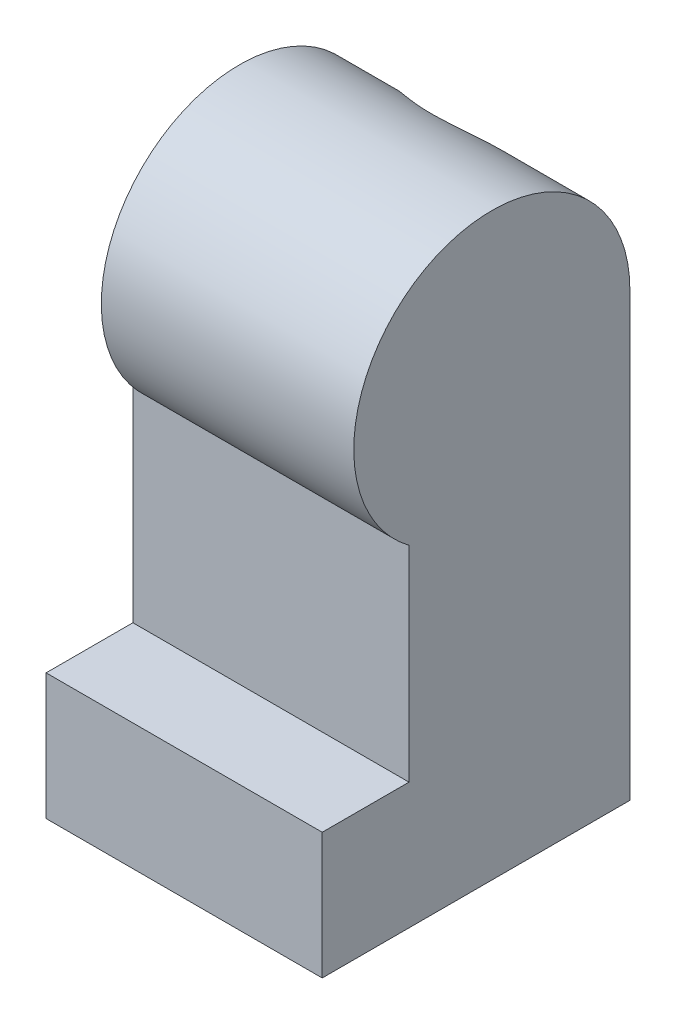
ISO-10303-21;
HEADER;
FILE_DESCRIPTION(('STEP AP214'),'2;1');
FILE_NAME('part.step','',(''),(''),'','','');
FILE_SCHEMA(('AUTOMOTIVE_DESIGN { 1 0 10303 214 1 1 1 1 }'));
ENDSEC;
DATA;
#1=APPLICATION_CONTEXT('core data for automotive mechanical design processes');
#2=APPLICATION_PROTOCOL_DEFINITION('international standard','automotive_design',2000,#1);
#3=PRODUCT_CONTEXT('',#1,'mechanical');
#4=PRODUCT('Part','Part','',(#3));
#5=PRODUCT_RELATED_PRODUCT_CATEGORY('part','',(#4));
#6=PRODUCT_DEFINITION_FORMATION('','',#4);
#7=PRODUCT_DEFINITION_CONTEXT('part definition',#1,'design');
#8=PRODUCT_DEFINITION('design','',#6,#7);
#9=PRODUCT_DEFINITION_SHAPE('','',#8);
#10=(LENGTH_UNIT() NAMED_UNIT(*) SI_UNIT(.MILLI.,.METRE.));
#11=(NAMED_UNIT(*) PLANE_ANGLE_UNIT() SI_UNIT($,.RADIAN.));
#12=(NAMED_UNIT(*) SI_UNIT($,.STERADIAN.) SOLID_ANGLE_UNIT());
#13=UNCERTAINTY_MEASURE_WITH_UNIT(LENGTH_MEASURE(1.E-05),#10,'distance_accuracy_value','');
#14=(GEOMETRIC_REPRESENTATION_CONTEXT(3) GLOBAL_UNCERTAINTY_ASSIGNED_CONTEXT((#13)) GLOBAL_UNIT_ASSIGNED_CONTEXT((#10,
#11,#12)) REPRESENTATION_CONTEXT('',''));
#15=CARTESIAN_POINT('',(0.,0.,0.));
#16=DIRECTION('',(0.,0.,1.));
#17=DIRECTION('',(1.,0.,0.));
#18=AXIS2_PLACEMENT_3D('',#15,#16,#17);
#19=CARTESIAN_POINT('',(-3.5,0.500000000000002,-1.7));
#20=DIRECTION('',(0.,0.,-1.));
#21=DIRECTION('',(0.,1.,0.));
#22=AXIS2_PLACEMENT_3D('',#19,#20,#21);
#23=PLANE('',#22);
#24=DIRECTION('',(-1.,0.,0.));
#25=VECTOR('',#24,1.);
#26=CARTESIAN_POINT('',(0.,2.2,-1.7));
#27=LINE('',#26,#25);
#28=CARTESIAN_POINT('',(-1.80589256539026,2.2,-1.7));
#29=VERTEX_POINT('',#28);
#30=CARTESIAN_POINT('',(-4.50589256539026,2.2,-1.7));
#31=VERTEX_POINT('',#30);
#32=EDGE_CURVE('E57',#29,#31,#27,.T.);
#33=ORIENTED_EDGE('',*,*,#32,.T.);
#34=DIRECTION('',(0.,-1.,0.));
#35=VECTOR('',#34,1.);
#36=CARTESIAN_POINT('',(-4.50589256539026,0.,-1.7));
#37=LINE('',#36,#35);
#38=CARTESIAN_POINT('',(-4.50589256539026,-1.67903192883734,-1.7));
#39=VERTEX_POINT('',#38);
#40=EDGE_CURVE('E181',#31,#39,#37,.T.);
#41=ORIENTED_EDGE('',*,*,#40,.T.);
#42=CARTESIAN_POINT('',(-3.5,0.500000000000002,-1.7));
#43=DIRECTION('',(0.,0.,-1.));
#44=DIRECTION('',(0.,1.,0.));
#45=AXIS2_PLACEMENT_3D('',#42,#43,#44);
#46=CIRCLE('',#45,2.4);
#47=EDGE_CURVE('E197',#39,#29,#46,.T.);
#48=ORIENTED_EDGE('',*,*,#47,.T.);
#49=EDGE_LOOP('',(#33,#41,#48));
#50=FACE_BOUND('',#49,.T.);
#51=ADVANCED_FACE('F37',(#50),#23,.T.);
#52=CARTESIAN_POINT('',(0.,-2.3,-1.8));
#53=DIRECTION('',(0.,0.,-1.));
#54=DIRECTION('',(0.,1.,0.));
#55=AXIS2_PLACEMENT_3D('',#52,#53,#54);
#56=PLANE('',#55);
#57=DIRECTION('',(0.,-1.,0.));
#58=VECTOR('',#57,1.);
#59=CARTESIAN_POINT('',(-1.1,-2.3,-1.8));
#60=LINE('',#59,#58);
#61=CARTESIAN_POINT('',(-1.1,-7.3,-1.8));
#62=VERTEX_POINT('',#61);
#63=CARTESIAN_POINT('',(-1.1,-11.2,-1.8));
#64=VERTEX_POINT('',#63);
#65=EDGE_CURVE('E421',#62,#64,#60,.T.);
#66=ORIENTED_EDGE('',*,*,#65,.F.);
#67=CARTESIAN_POINT('',(-3.5,-7.3,-1.8));
#68=DIRECTION('',(0.,0.,-1.));
#69=DIRECTION('',(0.,1.,0.));
#70=AXIS2_PLACEMENT_3D('',#67,#68,#69);
#71=CIRCLE('',#70,2.4);
#72=CARTESIAN_POINT('',(-5.9,-7.3,-1.8));
#73=VERTEX_POINT('',#72);
#74=EDGE_CURVE('E277',#62,#73,#71,.T.);
#75=ORIENTED_EDGE('',*,*,#74,.T.);
#76=DIRECTION('',(0.,-1.,0.));
#77=VECTOR('',#76,1.);
#78=CARTESIAN_POINT('',(-5.9,-2.3,-1.8));
#79=LINE('',#78,#77);
#80=CARTESIAN_POINT('',(-5.9,-11.2,-1.8));
#81=VERTEX_POINT('',#80);
#82=EDGE_CURVE('E427',#73,#81,#79,.T.);
#83=ORIENTED_EDGE('',*,*,#82,.T.);
#84=DIRECTION('',(1.,0.,0.));
#85=VECTOR('',#84,1.);
#86=CARTESIAN_POINT('',(0.,-11.2,-1.8));
#87=LINE('',#86,#85);
#88=EDGE_CURVE('E435',#81,#64,#87,.T.);
#89=ORIENTED_EDGE('',*,*,#88,.T.);
#90=EDGE_LOOP('',(#66,#75,#83,#89));
#91=FACE_BOUND('',#90,.T.);
#92=ADVANCED_FACE('F320',(#91),#56,.F.);
#93=CARTESIAN_POINT('',(-7.,-11.2,0.));
#94=DIRECTION('',(0.,1.,0.));
#95=DIRECTION('',(0.,0.,1.));
#96=AXIS2_PLACEMENT_3D('',#93,#94,#95);
#97=PLANE('',#96);
#98=DIRECTION('',(0.,0.,1.));
#99=VECTOR('',#98,1.);
#100=CARTESIAN_POINT('',(0.,-11.2,0.));
#101=LINE('',#100,#99);
#102=CARTESIAN_POINT('',(0.,-11.2,-3.5));
#103=VERTEX_POINT('',#102);
#104=CARTESIAN_POINT('',(0.,-11.2,4.3));
#105=VERTEX_POINT('',#104);
#106=EDGE_CURVE('E396',#103,#105,#101,.T.);
#107=ORIENTED_EDGE('',*,*,#106,.T.);
#108=DIRECTION('',(1.,0.,0.));
#109=VECTOR('',#108,1.);
#110=CARTESIAN_POINT('',(-7.,-11.2,4.3));
#111=LINE('',#110,#109);
#112=CARTESIAN_POINT('',(-7.,-11.2,4.3));
#113=VERTEX_POINT('',#112);
#114=EDGE_CURVE('E383',#113,#105,#111,.T.);
#115=ORIENTED_EDGE('',*,*,#114,.F.);
#116=DIRECTION('',(0.,0.,1.));
#117=VECTOR('',#116,1.);
#118=CARTESIAN_POINT('',(-7.,-11.2,0.));
#119=LINE('',#118,#117);
#120=CARTESIAN_POINT('',(-7.,-11.2,-3.5));
#121=VERTEX_POINT('',#120);
#122=EDGE_CURVE('E407',#121,#113,#119,.T.);
#123=ORIENTED_EDGE('',*,*,#122,.F.);
#124=DIRECTION('',(1.,0.,0.));
#125=VECTOR('',#124,1.);
#126=CARTESIAN_POINT('',(-7.,-11.2,-3.5));
#127=LINE('',#126,#125);
#128=EDGE_CURVE('E386',#121,#103,#127,.T.);
#129=ORIENTED_EDGE('',*,*,#128,.T.);
#130=EDGE_LOOP('',(#107,#115,#123,#129));
#131=FACE_BOUND('',#130,.T.);
#132=DIRECTION('',(0.,0.,1.));
#133=VECTOR('',#132,1.);
#134=CARTESIAN_POINT('',(-5.9,-11.2,0.));
#135=LINE('',#134,#133);
#136=CARTESIAN_POINT('',(-5.9,-11.2,2.9));
#137=VERTEX_POINT('',#136);
#138=EDGE_CURVE('E430',#81,#137,#135,.T.);
#139=ORIENTED_EDGE('',*,*,#138,.T.);
#140=DIRECTION('',(1.,0.,0.));
#141=VECTOR('',#140,1.);
#142=CARTESIAN_POINT('',(0.,-11.2,2.9));
#143=LINE('',#142,#141);
#144=CARTESIAN_POINT('',(-1.1,-11.2,2.9));
#145=VERTEX_POINT('',#144);
#146=EDGE_CURVE('E283',#137,#145,#143,.T.);
#147=ORIENTED_EDGE('',*,*,#146,.T.);
#148=DIRECTION('',(0.,0.,1.));
#149=VECTOR('',#148,1.);
#150=CARTESIAN_POINT('',(-1.1,-11.2,0.));
#151=LINE('',#150,#149);
#152=EDGE_CURVE('E433',#64,#145,#151,.T.);
#153=ORIENTED_EDGE('',*,*,#152,.F.);
#154=ORIENTED_EDGE('',*,*,#88,.F.);
#155=EDGE_LOOP('',(#139,#147,#153,#154));
#156=FACE_BOUND('',#155,.T.);
#157=ADVANCED_FACE('F311',(#131,#156),#97,.F.);
#158=CARTESIAN_POINT('',(0.,-2.3,1.5));
#159=DIRECTION('',(0.,0.,-1.));
#160=DIRECTION('',(0.,1.,0.));
#161=AXIS2_PLACEMENT_3D('',#158,#159,#160);
#162=PLANE('',#161);
#163=DIRECTION('',(0.,-1.,0.));
#164=VECTOR('',#163,1.);
#165=CARTESIAN_POINT('',(-1.1,-2.3,1.5));
#166=LINE('',#165,#164);
#167=CARTESIAN_POINT('',(-1.1,-2.3,1.5));
#168=VERTEX_POINT('',#167);
#169=CARTESIAN_POINT('',(-1.1,-9.2,1.5));
#170=VERTEX_POINT('',#169);
#171=EDGE_CURVE('E420',#168,#170,#166,.T.);
#172=ORIENTED_EDGE('',*,*,#171,.T.);
#173=DIRECTION('',(1.,0.,0.));
#174=VECTOR('',#173,1.);
#175=CARTESIAN_POINT('',(0.,-9.2,1.5));
#176=LINE('',#175,#174);
#177=CARTESIAN_POINT('',(-5.9,-9.2,1.5));
#178=VERTEX_POINT('',#177);
#179=EDGE_CURVE('E284',#178,#170,#176,.T.);
#180=ORIENTED_EDGE('',*,*,#179,.F.);
#181=DIRECTION('',(0.,-1.,0.));
#182=VECTOR('',#181,1.);
#183=CARTESIAN_POINT('',(-5.9,-2.3,1.5));
#184=LINE('',#183,#182);
#185=CARTESIAN_POINT('',(-5.9,-2.3,1.5));
#186=VERTEX_POINT('',#185);
#187=EDGE_CURVE('E424',#186,#178,#184,.T.);
#188=ORIENTED_EDGE('',*,*,#187,.F.);
#189=DIRECTION('',(1.,0.,0.));
#190=VECTOR('',#189,1.);
#191=CARTESIAN_POINT('',(0.,-2.3,1.5));
#192=LINE('',#191,#190);
#193=EDGE_CURVE('E441',#186,#168,#192,.T.);
#194=ORIENTED_EDGE('',*,*,#193,.T.);
#195=EDGE_LOOP('',(#172,#180,#188,#194));
#196=FACE_BOUND('',#195,.T.);
#197=ADVANCED_FACE('F308',(#196),#162,.T.);
#198=CARTESIAN_POINT('',(-6.4,0.,0.));
#199=DIRECTION('',(1.,0.,0.));
#200=DIRECTION('',(0.,0.,-1.));
#201=AXIS2_PLACEMENT_3D('',#198,#199,#200);
#202=CYLINDRICAL_SURFACE('',#201,3.5);
#203=CARTESIAN_POINT('',(-5.8473389188611,0.,-3.5));
#204=CARTESIAN_POINT('',(-5.85952324799212,0.0571477217374247,-3.50001181867057));
#205=CARTESIAN_POINT('',(-5.86959863933398,0.114743770065322,-3.49860061614223));
#206=CARTESIAN_POINT('',(-5.88551560428378,0.230360407827149,-3.49288728833139));
#207=CARTESIAN_POINT('',(-5.89135828784083,0.288380881929227,-3.48858592151156));
#208=CARTESIAN_POINT('',(-5.8987800738924,0.404089359673819,-3.47707880110764));
#209=CARTESIAN_POINT('',(-5.90038218120077,0.461777456069779,-3.46988896332483));
#210=CARTESIAN_POINT('',(-5.89946378384657,0.576676567862824,-3.45265487837301));
#211=CARTESIAN_POINT('',(-5.89694326407962,0.633887581511211,-3.44261062074615));
#212=CARTESIAN_POINT('',(-5.88336595556229,0.804105036209103,-3.4083356117771));
#213=CARTESIAN_POINT('',(-5.86630384227635,0.915869866292524,-3.37994514796454));
#214=CARTESIAN_POINT('',(-5.8176646602164,1.13314832429677,-3.31344895138059));
#215=CARTESIAN_POINT('',(-5.78607230536925,1.23865523648251,-3.27533300607753));
#216=CARTESIAN_POINT('',(-5.70809491628295,1.44731564674367,-3.18884504357403));
#217=CARTESIAN_POINT('',(-5.66097838899282,1.55000373794561,-3.14001706082533));
#218=CARTESIAN_POINT('',(-5.55467670041225,1.74526360748642,-3.03584021966201));
#219=CARTESIAN_POINT('',(-5.49548649772666,1.83783113507598,-2.98048864139242));
#220=CARTESIAN_POINT('',(-5.35353573776811,2.03018562272158,-2.85379750966277));
#221=CARTESIAN_POINT('',(-5.26842986956987,2.12760502281981,-2.78149734246403));
#222=CARTESIAN_POINT('',(-5.08471660055205,2.30698502977076,-2.63462775579363));
#223=CARTESIAN_POINT('',(-4.98609165576467,2.38892521486053,-2.56005548720432));
#224=CARTESIAN_POINT('',(-4.78326463330637,2.53162908276111,-2.41871956278776));
#225=CARTESIAN_POINT('',(-4.67995301376685,2.59348192527748,-2.3517770338946));
#226=CARTESIAN_POINT('',(-4.46138451080996,2.70240840583052,-2.22572729179699));
#227=CARTESIAN_POINT('',(-4.34615403536234,2.74951382379002,-2.16660339102304));
#228=CARTESIAN_POINT('',(-4.14772757712701,2.81234304649958,-2.08383834027692));
#229=CARTESIAN_POINT('',(-4.06831867472429,2.83323788763357,-2.05514190190293));
#230=CARTESIAN_POINT('',(-3.90499381872968,2.86704539023275,-2.0077106103014));
#231=CARTESIAN_POINT('',(-3.82108827656746,2.87997569256307,-1.98895375460871));
#232=CARTESIAN_POINT('',(-3.64949120839477,2.89690144617538,-1.9642337035912));
#233=CARTESIAN_POINT('',(-3.56176894903616,2.9008005995437,-1.95840842288825));
#234=CARTESIAN_POINT('',(-3.38665261282273,2.89892227463507,-1.96118525247281));
#235=CARTESIAN_POINT('',(-3.2992586376826,2.89314201115589,-1.96979151536345));
#236=CARTESIAN_POINT('',(-3.11997573015766,2.87160130715171,-2.0010690476172));
#237=CARTESIAN_POINT('',(-3.02841815728649,2.85496763238069,-2.02496702821198));
#238=CARTESIAN_POINT('',(-2.85105317430008,2.81241019263364,-2.08366151371945));
#239=CARTESIAN_POINT('',(-2.76526360077856,2.78645905439294,-2.11849009267811));
#240=CARTESIAN_POINT('',(-2.61773079012412,2.73301571417906,-2.18679788954712));
#241=CARTESIAN_POINT('',(-2.55478723431316,2.70705840232988,-2.21895300854011));
#242=CARTESIAN_POINT('',(-2.43253952688268,2.6505953738598,-2.28610481874925));
#243=CARTESIAN_POINT('',(-2.37323749385825,2.62008704424715,-2.32110313711189));
#244=CARTESIAN_POINT('',(-2.20045968614499,2.52207206221612,-2.42868720689748));
#245=CARTESIAN_POINT('',(-2.09218099861509,2.4481010718627,-2.50382746204864));
#246=CARTESIAN_POINT('',(-1.88360823330202,2.27939132717921,-2.65861963929727));
#247=CARTESIAN_POINT('',(-1.78407812901597,2.18373583955497,-2.73829291655651));
#248=CARTESIAN_POINT('',(-1.60137340449738,1.97459276266238,-2.89271972414266));
#249=CARTESIAN_POINT('',(-1.51817479248159,1.86113177857626,-2.96748036225121));
#250=CARTESIAN_POINT('',(-1.3827076469627,1.63641660452187,-3.09615262794245));
#251=CARTESIAN_POINT('',(-1.32762439761678,1.52768128659246,-3.1514891082545));
#252=CARTESIAN_POINT('',(-1.23355837193325,1.29903752936263,-3.25238946581503));
#253=CARTESIAN_POINT('',(-1.19457083515538,1.17913240650189,-3.29795623061858));
#254=CARTESIAN_POINT('',(-1.1501708545183,0.992412245075312,-3.35700281785587));
#255=CARTESIAN_POINT('',(-1.13769076115729,0.928685601014829,-3.37520301505509));
#256=CARTESIAN_POINT('',(-1.11787508897714,0.799562026687039,-3.40809707788925));
#257=CARTESIAN_POINT('',(-1.11053670135105,0.734166028622356,-3.42279285501696));
#258=CARTESIAN_POINT('',(-1.1012748142032,0.602361890113004,-3.44842924317227));
#259=CARTESIAN_POINT('',(-1.09934358386222,0.535955331323925,-3.45937519578144));
#260=CARTESIAN_POINT('',(-1.10104813363846,0.402723056835077,-3.47740236223998));
#261=CARTESIAN_POINT('',(-1.10468020548551,0.335897649885479,-3.4844861461866));
#262=CARTESIAN_POINT('',(-1.1154853741884,0.224046580330875,-3.49311564200003));
#263=CARTESIAN_POINT('',(-1.12113712347402,0.178946589127802,-3.49571088870466));
#264=CARTESIAN_POINT('',(-1.1349923537418,0.0891432677126933,-3.49915350020635));
#265=CARTESIAN_POINT('',(-1.14319194086814,0.0444394385561719,-3.50000351725482));
#266=CARTESIAN_POINT('',(-1.15266108113889,0.,-3.5));
#267=B_SPLINE_CURVE_WITH_KNOTS('',3,(#203,#204,#205,#206,#207,#208,#209,#210,#211,#212,#213,
#214,#215,#216,#217,#218,#219,#220,#221,#222,#223,#224,#225,#226,#227,#228,#229,#230,#231,#232,
#233,#234,#235,#236,#237,#238,#239,#240,#241,#242,#243,#244,#245,#246,#247,#248,#249,#250,#251,
#252,#253,#254,#255,#256,#257,#258,#259,#260,#261,#262,#263,#264,#265,#266),.UNSPECIFIED.,.F.,
.F.,(4,2,2,2,2,2,2,2,2,2,2,2,2,2,2,2,2,2,2,2,2,2,2,2,2,2,2,2,2,2,2,4),(0.,0.175237440381033,
0.35042891134353,0.524668014814338,0.698907756660255,1.04686867533735,1.39519649537508,
1.76309807782818,2.13115359418281,2.57414809278723,3.01772301461145,3.42986501795747,
3.84111266440891,4.10124897819194,4.36080701764205,4.62312019539684,4.88550886538463,
5.17215450827924,5.45964925644542,5.68524281978454,5.91096641102047,6.36265437457838,
6.83912330739456,7.31488695708917,7.71498529590946,8.11496521741379,8.31702682714792,
8.51897796858323,8.720640224955,8.92216811998134,9.05864817270439,9.19492066068158),.UNSPECIFIED.);
#268=CARTESIAN_POINT('',(-5.8473389188611,0.,-3.5));
#269=VERTEX_POINT('',#268);
#270=CARTESIAN_POINT('',(-1.1526610811389,0.,-3.5));
#271=VERTEX_POINT('',#270);
#272=EDGE_CURVE('E64',#269,#271,#267,.T.);
#273=ORIENTED_EDGE('',*,*,#272,.F.);
#274=DIRECTION('',(1.,0.,0.));
#275=VECTOR('',#274,1.);
#276=CARTESIAN_POINT('',(-7.,0.,-3.5));
#277=LINE('',#276,#275);
#278=CARTESIAN_POINT('',(-6.4,0.,-3.5));
#279=VERTEX_POINT('',#278);
#280=EDGE_CURVE('E392',#279,#269,#277,.T.);
#281=ORIENTED_EDGE('',*,*,#280,.F.);
#282=CARTESIAN_POINT('',(-6.4,0.,0.));
#283=DIRECTION('',(1.,0.,0.));
#284=DIRECTION('',(0.,0.,-1.));
#285=AXIS2_PLACEMENT_3D('',#282,#283,#284);
#286=CIRCLE('',#285,3.5);
#287=CARTESIAN_POINT('',(-6.4,-2.8,2.1));
#288=VERTEX_POINT('',#287);
#289=EDGE_CURVE('E12',#279,#288,#286,.T.);
#290=ORIENTED_EDGE('',*,*,#289,.T.);
#291=DIRECTION('',(1.,0.,0.));
#292=VECTOR('',#291,1.);
#293=CARTESIAN_POINT('',(-7.,-2.8,2.1));
#294=LINE('',#293,#292);
#295=CARTESIAN_POINT('',(0.,-2.8,2.1));
#296=VERTEX_POINT('',#295);
#297=EDGE_CURVE('E377',#288,#296,#294,.T.);
#298=ORIENTED_EDGE('',*,*,#297,.T.);
#299=CARTESIAN_POINT('',(0.,0.,0.));
#300=DIRECTION('',(1.,0.,0.));
#301=DIRECTION('',(0.,0.,-1.));
#302=AXIS2_PLACEMENT_3D('',#299,#300,#301);
#303=CIRCLE('',#302,3.5);
#304=CARTESIAN_POINT('',(0.,0.,-3.5));
#305=VERTEX_POINT('',#304);
#306=EDGE_CURVE('E49',#305,#296,#303,.T.);
#307=ORIENTED_EDGE('',*,*,#306,.F.);
#308=EDGE_CURVE('E389',#271,#305,#277,.T.);
#309=ORIENTED_EDGE('',*,*,#308,.F.);
#310=EDGE_LOOP('',(#273,#281,#290,#298,#307,#309));
#311=FACE_BOUND('',#310,.T.);
#312=ADVANCED_FACE('F39',(#311),#202,.T.);
#313=CARTESIAN_POINT('',(-6.4,0.,0.));
#314=DIRECTION('',(1.,0.,0.));
#315=DIRECTION('',(0.,0.,-1.));
#316=AXIS2_PLACEMENT_3D('',#313,#314,#315);
#317=PLANE('',#316);
#318=CARTESIAN_POINT('',(-6.4,0.,0.));
#319=DIRECTION('',(-1.,0.,0.));
#320=DIRECTION('',(0.,0.,1.));
#321=AXIS2_PLACEMENT_3D('',#318,#319,#320);
#322=CIRCLE('',#321,1.125);
#323=CARTESIAN_POINT('',(-6.4,0.,1.125));
#324=VERTEX_POINT('',#323);
#325=EDGE_CURVE('E203',#324,#324,#322,.T.);
#326=ORIENTED_EDGE('',*,*,#325,.F.);
#327=EDGE_LOOP('',(#326));
#328=FACE_BOUND('',#327,.T.);
#329=ORIENTED_EDGE('',*,*,#289,.F.);
#330=CARTESIAN_POINT('',(-6.4,0.,0.));
#331=DIRECTION('',(1.,0.,0.));
#332=DIRECTION('',(0.,0.,-1.));
#333=AXIS2_PLACEMENT_3D('',#330,#331,#332);
#334=CIRCLE('',#333,3.5);
#335=EDGE_CURVE('E369',#288,#279,#334,.T.);
#336=ORIENTED_EDGE('',*,*,#335,.F.);
#337=EDGE_LOOP('',(#329,#336));
#338=FACE_BOUND('',#337,.T.);
#339=ADVANCED_FACE('F348',(#328,#338),#317,.F.);
#340=CARTESIAN_POINT('',(0.,0.,0.));
#341=DIRECTION('',(1.,0.,0.));
#342=DIRECTION('',(0.,0.,-1.));
#343=AXIS2_PLACEMENT_3D('',#340,#341,#342);
#344=PLANE('',#343);
#345=ORIENTED_EDGE('',*,*,#306,.T.);
#346=DIRECTION('',(0.,1.,0.));
#347=VECTOR('',#346,1.);
#348=CARTESIAN_POINT('',(0.,0.,2.1));
#349=LINE('',#348,#347);
#350=CARTESIAN_POINT('',(0.,-8.,2.1));
#351=VERTEX_POINT('',#350);
#352=EDGE_CURVE('E402',#351,#296,#349,.T.);
#353=ORIENTED_EDGE('',*,*,#352,.F.);
#354=DIRECTION('',(0.,0.,-1.));
#355=VECTOR('',#354,1.);
#356=CARTESIAN_POINT('',(0.,-8.,0.));
#357=LINE('',#356,#355);
#358=CARTESIAN_POINT('',(0.,-8.,4.3));
#359=VERTEX_POINT('',#358);
#360=EDGE_CURVE('E400',#359,#351,#357,.T.);
#361=ORIENTED_EDGE('',*,*,#360,.F.);
#362=DIRECTION('',(0.,1.,0.));
#363=VECTOR('',#362,1.);
#364=CARTESIAN_POINT('',(0.,0.,4.3));
#365=LINE('',#364,#363);
#366=EDGE_CURVE('E398',#105,#359,#365,.T.);
#367=ORIENTED_EDGE('',*,*,#366,.F.);
#368=ORIENTED_EDGE('',*,*,#106,.F.);
#369=DIRECTION('',(0.,-1.,0.));
#370=VECTOR('',#369,1.);
#371=CARTESIAN_POINT('',(0.,0.,-3.5));
#372=LINE('',#371,#370);
#373=EDGE_CURVE('E393',#305,#103,#372,.T.);
#374=ORIENTED_EDGE('',*,*,#373,.F.);
#375=EDGE_LOOP('',(#345,#353,#361,#367,#368,#374));
#376=FACE_BOUND('',#375,.T.);
#377=ADVANCED_FACE('F346',(#376),#344,.T.);
#378=CARTESIAN_POINT('',(-7.,0.,0.));
#379=DIRECTION('',(1.,0.,0.));
#380=DIRECTION('',(0.,0.,-1.));
#381=AXIS2_PLACEMENT_3D('',#378,#379,#380);
#382=CYLINDRICAL_SURFACE('',#381,3.5);
#383=CARTESIAN_POINT('',(-7.,-2.8,2.1));
#384=VERTEX_POINT('',#383);
#385=EDGE_CURVE('E373',#384,#288,#294,.T.);
#386=ORIENTED_EDGE('',*,*,#385,.T.);
#387=ORIENTED_EDGE('',*,*,#335,.T.);
#388=CARTESIAN_POINT('',(-7.,0.,-3.5));
#389=VERTEX_POINT('',#388);
#390=EDGE_CURVE('E372',#389,#279,#277,.T.);
#391=ORIENTED_EDGE('',*,*,#390,.F.);
#392=CARTESIAN_POINT('',(-7.,0.,0.));
#393=DIRECTION('',(1.,0.,0.));
#394=DIRECTION('',(0.,0.,-1.));
#395=AXIS2_PLACEMENT_3D('',#392,#393,#394);
#396=CIRCLE('',#395,3.5);
#397=EDGE_CURVE('E395',#384,#389,#396,.T.);
#398=ORIENTED_EDGE('',*,*,#397,.F.);
#399=EDGE_LOOP('',(#386,#387,#391,#398));
#400=FACE_BOUND('',#399,.T.);
#401=ADVANCED_FACE('F329',(#400),#382,.F.);
#402=CARTESIAN_POINT('',(-7.,0.,-3.5));
#403=DIRECTION('',(0.,0.,1.));
#404=DIRECTION('',(0.,-1.,0.));
#405=AXIS2_PLACEMENT_3D('',#402,#403,#404);
#406=PLANE('',#405);
#407=CARTESIAN_POINT('',(-3.5,-7.3,-3.5));
#408=DIRECTION('',(0.,0.,-1.));
#409=DIRECTION('',(0.,1.,0.));
#410=AXIS2_PLACEMENT_3D('',#407,#408,#409);
#411=CIRCLE('',#410,2.4);
#412=CARTESIAN_POINT('',(-3.5,-4.9,-3.5));
#413=VERTEX_POINT('',#412);
#414=EDGE_CURVE('E271',#413,#413,#411,.T.);
#415=ORIENTED_EDGE('',*,*,#414,.F.);
#416=EDGE_LOOP('',(#415));
#417=FACE_BOUND('',#416,.T.);
#418=ORIENTED_EDGE('',*,*,#280,.T.);
#419=CARTESIAN_POINT('',(-3.5,0.500000000000002,-3.5));
#420=DIRECTION('',(0.,0.,-1.));
#421=DIRECTION('',(0.,1.,0.));
#422=AXIS2_PLACEMENT_3D('',#419,#420,#421);
#423=CIRCLE('',#422,2.4);
#424=EDGE_CURVE('E264',#271,#269,#423,.T.);
#425=ORIENTED_EDGE('',*,*,#424,.F.);
#426=ORIENTED_EDGE('',*,*,#308,.T.);
#427=ORIENTED_EDGE('',*,*,#373,.T.);
#428=ORIENTED_EDGE('',*,*,#128,.F.);
#429=DIRECTION('',(0.,-1.,0.));
#430=VECTOR('',#429,1.);
#431=CARTESIAN_POINT('',(-7.,0.,-3.5));
#432=LINE('',#431,#430);
#433=EDGE_CURVE('E405',#389,#121,#432,.T.);
#434=ORIENTED_EDGE('',*,*,#433,.F.);
#435=ORIENTED_EDGE('',*,*,#390,.T.);
#436=EDGE_LOOP('',(#418,#425,#426,#427,#428,#434,#435));
#437=FACE_BOUND('',#436,.T.);
#438=ADVANCED_FACE('F325',(#417,#437),#406,.F.);
#439=CARTESIAN_POINT('',(-7.,0.,4.3));
#440=DIRECTION('',(0.,0.,-1.));
#441=DIRECTION('',(0.,1.,0.));
#442=AXIS2_PLACEMENT_3D('',#439,#440,#441);
#443=PLANE('',#442);
#444=ORIENTED_EDGE('',*,*,#366,.T.);
#445=DIRECTION('',(1.,0.,0.));
#446=VECTOR('',#445,1.);
#447=CARTESIAN_POINT('',(-7.,-8.,4.3));
#448=LINE('',#447,#446);
#449=CARTESIAN_POINT('',(-7.,-8.,4.3));
#450=VERTEX_POINT('',#449);
#451=EDGE_CURVE('E380',#450,#359,#448,.T.);
#452=ORIENTED_EDGE('',*,*,#451,.F.);
#453=DIRECTION('',(0.,1.,0.));
#454=VECTOR('',#453,1.);
#455=CARTESIAN_POINT('',(-7.,0.,4.3));
#456=LINE('',#455,#454);
#457=EDGE_CURVE('E409',#113,#450,#456,.T.);
#458=ORIENTED_EDGE('',*,*,#457,.F.);
#459=ORIENTED_EDGE('',*,*,#114,.T.);
#460=EDGE_LOOP('',(#444,#452,#458,#459));
#461=FACE_BOUND('',#460,.T.);
#462=ADVANCED_FACE('F328',(#461),#443,.F.);
#463=CARTESIAN_POINT('',(-7.,-8.,0.));
#464=DIRECTION('',(0.,-1.,0.));
#465=DIRECTION('',(0.,0.,-1.));
#466=AXIS2_PLACEMENT_3D('',#463,#464,#465);
#467=PLANE('',#466);
#468=ORIENTED_EDGE('',*,*,#360,.T.);
#469=DIRECTION('',(1.,0.,0.));
#470=VECTOR('',#469,1.);
#471=CARTESIAN_POINT('',(-7.,-8.,2.1));
#472=LINE('',#471,#470);
#473=CARTESIAN_POINT('',(-7.,-8.,2.1));
#474=VERTEX_POINT('',#473);
#475=EDGE_CURVE('E376',#474,#351,#472,.T.);
#476=ORIENTED_EDGE('',*,*,#475,.F.);
#477=DIRECTION('',(0.,0.,-1.));
#478=VECTOR('',#477,1.);
#479=CARTESIAN_POINT('',(-7.,-8.,0.));
#480=LINE('',#479,#478);
#481=EDGE_CURVE('E411',#450,#474,#480,.T.);
#482=ORIENTED_EDGE('',*,*,#481,.F.);
#483=ORIENTED_EDGE('',*,*,#451,.T.);
#484=EDGE_LOOP('',(#468,#476,#482,#483));
#485=FACE_BOUND('',#484,.T.);
#486=ADVANCED_FACE('F336',(#485),#467,.F.);
#487=CARTESIAN_POINT('',(-7.,0.,2.1));
#488=DIRECTION('',(0.,0.,-1.));
#489=DIRECTION('',(0.,1.,0.));
#490=AXIS2_PLACEMENT_3D('',#487,#488,#489);
#491=PLANE('',#490);
#492=ORIENTED_EDGE('',*,*,#352,.T.);
#493=ORIENTED_EDGE('',*,*,#297,.F.);
#494=ORIENTED_EDGE('',*,*,#385,.F.);
#495=DIRECTION('',(0.,1.,0.));
#496=VECTOR('',#495,1.);
#497=CARTESIAN_POINT('',(-7.,0.,2.1));
#498=LINE('',#497,#496);
#499=EDGE_CURVE('E413',#474,#384,#498,.T.);
#500=ORIENTED_EDGE('',*,*,#499,.F.);
#501=ORIENTED_EDGE('',*,*,#475,.T.);
#502=EDGE_LOOP('',(#492,#493,#494,#500,#501));
#503=FACE_BOUND('',#502,.T.);
#504=ADVANCED_FACE('F323',(#503),#491,.F.);
#505=CARTESIAN_POINT('',(-7.,0.,0.));
#506=DIRECTION('',(1.,0.,0.));
#507=DIRECTION('',(0.,0.,-1.));
#508=AXIS2_PLACEMENT_3D('',#505,#506,#507);
#509=PLANE('',#508);
#510=ORIENTED_EDGE('',*,*,#397,.T.);
#511=ORIENTED_EDGE('',*,*,#433,.T.);
#512=ORIENTED_EDGE('',*,*,#122,.T.);
#513=ORIENTED_EDGE('',*,*,#457,.T.);
#514=ORIENTED_EDGE('',*,*,#481,.T.);
#515=ORIENTED_EDGE('',*,*,#499,.T.);
#516=EDGE_LOOP('',(#510,#511,#512,#513,#514,#515));
#517=FACE_BOUND('',#516,.T.);
#518=ADVANCED_FACE('F318',(#517),#509,.F.);
#519=CARTESIAN_POINT('',(-5.9,-2.3,-1.8));
#520=VERTEX_POINT('',#519);
#521=EDGE_CURVE('E404',#520,#73,#79,.T.);
#522=ORIENTED_EDGE('',*,*,#521,.T.);
#523=EDGE_CURVE('E274',#73,#62,#71,.T.);
#524=ORIENTED_EDGE('',*,*,#523,.T.);
#525=CARTESIAN_POINT('',(-1.1,-2.3,-1.8));
#526=VERTEX_POINT('',#525);
#527=EDGE_CURVE('E417',#526,#62,#60,.T.);
#528=ORIENTED_EDGE('',*,*,#527,.F.);
#529=DIRECTION('',(1.,0.,0.));
#530=VECTOR('',#529,1.);
#531=CARTESIAN_POINT('',(0.,-2.3,-1.8));
#532=LINE('',#531,#530);
#533=EDGE_CURVE('E432',#520,#526,#532,.T.);
#534=ORIENTED_EDGE('',*,*,#533,.F.);
#535=EDGE_LOOP('',(#522,#524,#528,#534));
#536=FACE_BOUND('',#535,.T.);
#537=ADVANCED_FACE('F306',(#536),#56,.F.);
#538=CARTESIAN_POINT('',(-5.9,-2.3,0.));
#539=DIRECTION('',(1.,0.,0.));
#540=DIRECTION('',(0.,0.,-1.));
#541=AXIS2_PLACEMENT_3D('',#538,#539,#540);
#542=PLANE('',#541);
#543=ORIENTED_EDGE('',*,*,#82,.F.);
#544=ORIENTED_EDGE('',*,*,#521,.F.);
#545=DIRECTION('',(0.,0.,1.));
#546=VECTOR('',#545,1.);
#547=CARTESIAN_POINT('',(-5.9,-2.3,0.));
#548=LINE('',#547,#546);
#549=EDGE_CURVE('E439',#520,#186,#548,.T.);
#550=ORIENTED_EDGE('',*,*,#549,.T.);
#551=ORIENTED_EDGE('',*,*,#187,.T.);
#552=DIRECTION('',(0.,0.,1.));
#553=VECTOR('',#552,1.);
#554=CARTESIAN_POINT('',(-5.9,-9.2,0.));
#555=LINE('',#554,#553);
#556=CARTESIAN_POINT('',(-5.9,-9.2,2.9));
#557=VERTEX_POINT('',#556);
#558=EDGE_CURVE('E451',#178,#557,#555,.T.);
#559=ORIENTED_EDGE('',*,*,#558,.T.);
#560=DIRECTION('',(0.,-1.,0.));
#561=VECTOR('',#560,1.);
#562=CARTESIAN_POINT('',(-5.9,-9.2,2.9));
#563=LINE('',#562,#561);
#564=EDGE_CURVE('E438',#557,#137,#563,.T.);
#565=ORIENTED_EDGE('',*,*,#564,.T.);
#566=ORIENTED_EDGE('',*,*,#138,.F.);
#567=EDGE_LOOP('',(#543,#544,#550,#551,#559,#565,#566));
#568=FACE_BOUND('',#567,.T.);
#569=ADVANCED_FACE('F303',(#568),#542,.T.);
#570=CARTESIAN_POINT('',(-1.1,-2.3,0.));
#571=DIRECTION('',(1.,0.,0.));
#572=DIRECTION('',(0.,0.,-1.));
#573=AXIS2_PLACEMENT_3D('',#570,#571,#572);
#574=PLANE('',#573);
#575=ORIENTED_EDGE('',*,*,#527,.T.);
#576=ORIENTED_EDGE('',*,*,#65,.T.);
#577=ORIENTED_EDGE('',*,*,#152,.T.);
#578=DIRECTION('',(0.,-1.,0.));
#579=VECTOR('',#578,1.);
#580=CARTESIAN_POINT('',(-1.1,-9.2,2.9));
#581=LINE('',#580,#579);
#582=CARTESIAN_POINT('',(-1.1,-9.2,2.9));
#583=VERTEX_POINT('',#582);
#584=EDGE_CURVE('E448',#583,#145,#581,.T.);
#585=ORIENTED_EDGE('',*,*,#584,.F.);
#586=DIRECTION('',(0.,0.,1.));
#587=VECTOR('',#586,1.);
#588=CARTESIAN_POINT('',(-1.1,-9.2,0.));
#589=LINE('',#588,#587);
#590=EDGE_CURVE('E458',#170,#583,#589,.T.);
#591=ORIENTED_EDGE('',*,*,#590,.F.);
#592=ORIENTED_EDGE('',*,*,#171,.F.);
#593=DIRECTION('',(0.,0.,1.));
#594=VECTOR('',#593,1.);
#595=CARTESIAN_POINT('',(-1.1,-2.3,0.));
#596=LINE('',#595,#594);
#597=EDGE_CURVE('E443',#526,#168,#596,.T.);
#598=ORIENTED_EDGE('',*,*,#597,.F.);
#599=EDGE_LOOP('',(#575,#576,#577,#585,#591,#592,#598));
#600=FACE_BOUND('',#599,.T.);
#601=ADVANCED_FACE('F301',(#600),#574,.F.);
#602=CARTESIAN_POINT('',(0.,-2.3,0.));
#603=DIRECTION('',(0.,-1.,0.));
#604=DIRECTION('',(0.,0.,-1.));
#605=AXIS2_PLACEMENT_3D('',#602,#603,#604);
#606=PLANE('',#605);
#607=ORIENTED_EDGE('',*,*,#533,.T.);
#608=ORIENTED_EDGE('',*,*,#597,.T.);
#609=ORIENTED_EDGE('',*,*,#193,.F.);
#610=ORIENTED_EDGE('',*,*,#549,.F.);
#611=EDGE_LOOP('',(#607,#608,#609,#610));
#612=FACE_BOUND('',#611,.T.);
#613=ADVANCED_FACE('F297',(#612),#606,.T.);
#614=CARTESIAN_POINT('',(0.,-9.2,2.9));
#615=DIRECTION('',(0.,0.,-1.));
#616=DIRECTION('',(0.,1.,0.));
#617=AXIS2_PLACEMENT_3D('',#614,#615,#616);
#618=PLANE('',#617);
#619=ORIENTED_EDGE('',*,*,#146,.F.);
#620=ORIENTED_EDGE('',*,*,#564,.F.);
#621=DIRECTION('',(1.,0.,0.));
#622=VECTOR('',#621,1.);
#623=CARTESIAN_POINT('',(0.,-9.2,2.9));
#624=LINE('',#623,#622);
#625=EDGE_CURVE('E457',#557,#583,#624,.T.);
#626=ORIENTED_EDGE('',*,*,#625,.T.);
#627=ORIENTED_EDGE('',*,*,#584,.T.);
#628=EDGE_LOOP('',(#619,#620,#626,#627));
#629=FACE_BOUND('',#628,.T.);
#630=ADVANCED_FACE('F293',(#629),#618,.T.);
#631=CARTESIAN_POINT('',(0.,-9.2,0.));
#632=DIRECTION('',(0.,-1.,0.));
#633=DIRECTION('',(0.,0.,-1.));
#634=AXIS2_PLACEMENT_3D('',#631,#632,#633);
#635=PLANE('',#634);
#636=ORIENTED_EDGE('',*,*,#179,.T.);
#637=ORIENTED_EDGE('',*,*,#590,.T.);
#638=ORIENTED_EDGE('',*,*,#625,.F.);
#639=ORIENTED_EDGE('',*,*,#558,.F.);
#640=EDGE_LOOP('',(#636,#637,#638,#639));
#641=FACE_BOUND('',#640,.T.);
#642=ADVANCED_FACE('F289',(#641),#635,.T.);
#643=CARTESIAN_POINT('',(-3.5,-7.3,-1.7));
#644=DIRECTION('',(0.,0.,-1.));
#645=DIRECTION('',(0.,1.,0.));
#646=AXIS2_PLACEMENT_3D('',#643,#644,#645);
#647=CYLINDRICAL_SURFACE('',#646,2.4);
#648=ORIENTED_EDGE('',*,*,#414,.T.);
#649=EDGE_LOOP('',(#648));
#650=FACE_BOUND('',#649,.T.);
#651=ORIENTED_EDGE('',*,*,#523,.F.);
#652=ORIENTED_EDGE('',*,*,#74,.F.);
#653=EDGE_LOOP('',(#651,#652));
#654=FACE_BOUND('',#653,.T.);
#655=ADVANCED_FACE('F239',(#650,#654),#647,.F.);
#656=CARTESIAN_POINT('',(-3.5,0.500000000000002,-1.7));
#657=DIRECTION('',(0.,0.,-1.));
#658=DIRECTION('',(0.,1.,0.));
#659=AXIS2_PLACEMENT_3D('',#656,#657,#658);
#660=CYLINDRICAL_SURFACE('',#659,2.4);
#661=ORIENTED_EDGE('',*,*,#272,.T.);
#662=ORIENTED_EDGE('',*,*,#424,.T.);
#663=EDGE_LOOP('',(#661,#662));
#664=FACE_BOUND('',#663,.T.);
#665=CARTESIAN_POINT('',(-1.80589256539026,-1.2,-1.7));
#666=VERTEX_POINT('',#665);
#667=EDGE_CURVE('E269',#29,#666,#46,.T.);
#668=ORIENTED_EDGE('',*,*,#667,.F.);
#669=ORIENTED_EDGE('',*,*,#47,.F.);
#670=DIRECTION('',(0.,0.,-1.));
#671=VECTOR('',#670,1.);
#672=CARTESIAN_POINT('',(-4.50589256539026,-1.67903192883735,6.701));
#673=LINE('',#672,#671);
#674=CARTESIAN_POINT('',(-4.50589256539026,-1.67903192883734,1.57189432912799));
#675=VERTEX_POINT('',#674);
#676=EDGE_CURVE('E186',#675,#39,#673,.T.);
#677=ORIENTED_EDGE('',*,*,#676,.F.);
#678=CARTESIAN_POINT('',(-4.03329166503893,-1.84,1.38));
#679=CARTESIAN_POINT('',(-4.0751437578678,-1.83045975727594,1.39272341654453));
#680=CARTESIAN_POINT('',(-4.11639656717299,-1.81987920856244,1.40655351959038));
#681=CARTESIAN_POINT('',(-4.19755767122536,-1.79677805251896,1.43594367086238));
#682=CARTESIAN_POINT('',(-4.2374701083403,-1.78426425445949,1.45149759511151));
#683=CARTESIAN_POINT('',(-4.31608590615937,-1.75737242312821,1.48394268682891));
#684=CARTESIAN_POINT('',(-4.35478948242254,-1.74299472460176,1.50083361396788));
#685=CARTESIAN_POINT('',(-4.43115457838779,-1.71238447403466,1.53567007040377));
#686=CARTESIAN_POINT('',(-4.46881203397668,-1.69614568268615,1.55361904301443));
#687=CARTESIAN_POINT('',(-4.50589256539026,-1.67903192883735,1.57189432912799));
#688=B_SPLINE_CURVE_WITH_KNOTS('',3,(#678,#679,#680,#681,#682,#683,#684,#685,#686,#687),
.UNSPECIFIED.,.F.,.F.,(4,2,2,2,4),(0.,0.134250868332407,0.268039229193869,0.401803595668833,
0.536030302118044),.UNSPECIFIED.);
#689=CARTESIAN_POINT('',(-4.03329166503893,-1.84,1.38));
#690=VERTEX_POINT('',#689);
#691=EDGE_CURVE('E210',#690,#675,#688,.T.);
#692=ORIENTED_EDGE('',*,*,#691,.F.);
#693=CARTESIAN_POINT('',(-3.5,0.500000000000001,1.38));
#694=DIRECTION('',(0.,0.,1.));
#695=DIRECTION('',(-0.222204860432888,-0.975000000000001,0.));
#696=AXIS2_PLACEMENT_3D('',#693,#694,#695);
#697=CIRCLE('',#696,2.4);
#698=CARTESIAN_POINT('',(-2.96670833496107,-1.84,1.38));
#699=VERTEX_POINT('',#698);
#700=EDGE_CURVE('E199',#690,#699,#697,.T.);
#701=ORIENTED_EDGE('',*,*,#700,.T.);
#702=CARTESIAN_POINT('',(-1.80589256539026,-1.2,1.96214168703486));
#703=CARTESIAN_POINT('',(-1.8581123503325,-1.25200974738039,1.93034342687488));
#704=CARTESIAN_POINT('',(-1.91231522101507,-1.30126071437639,1.89737290013413));
#705=CARTESIAN_POINT('',(-2.02451821884151,-1.39427857563876,1.83010183875141));
#706=CARTESIAN_POINT('',(-2.08251972294991,-1.43804346432022,1.79580082367912));
#707=CARTESIAN_POINT('',(-2.20073120665786,-1.51913703482202,1.72770382984711));
#708=CARTESIAN_POINT('',(-2.26085920222232,-1.55659105595429,1.69391449210442));
#709=CARTESIAN_POINT('',(-2.38452268454705,-1.62620388782074,1.62720223933702));
#710=CARTESIAN_POINT('',(-2.4480568151546,-1.65836478555715,1.59427898714991));
#711=CARTESIAN_POINT('',(-2.58414275014103,-1.71973972043444,1.52796699449234));
#712=CARTESIAN_POINT('',(-2.65700475643722,-1.74848452080668,1.49476829380878));
#713=CARTESIAN_POINT('',(-2.80801118695719,-1.79946266655315,1.43304186301554));
#714=CARTESIAN_POINT('',(-2.88621062245504,-1.82160936127315,1.40457829033614));
#715=CARTESIAN_POINT('',(-2.96670833496107,-1.84,1.38));
#716=B_SPLINE_CURVE_WITH_KNOTS('',3,(#702,#703,#704,#705,#706,#707,#708,#709,#710,#711,#712,
#713,#714,#715),.UNSPECIFIED.,.F.,.F.,(4,2,2,2,2,2,4),(0.,0.24067892450024,0.481445580692788,
0.716649637191049,0.951760732793327,1.20647363040687,1.46439741701102),.UNSPECIFIED.);
#717=CARTESIAN_POINT('',(-1.80589256539026,-1.2,1.96214168703486));
#718=VERTEX_POINT('',#717);
#719=EDGE_CURVE('E195',#718,#699,#716,.T.);
#720=ORIENTED_EDGE('',*,*,#719,.F.);
#721=DIRECTION('',(0.,0.,-1.));
#722=VECTOR('',#721,1.);
#723=CARTESIAN_POINT('',(-1.80589256539026,-1.2,6.701));
#724=LINE('',#723,#722);
#725=EDGE_CURVE('E261',#718,#666,#724,.T.);
#726=ORIENTED_EDGE('',*,*,#725,.T.);
#727=EDGE_LOOP('',(#668,#669,#677,#692,#701,#720,#726));
#728=FACE_BOUND('',#727,.T.);
#729=ADVANCED_FACE('F267',(#664,#728),#660,.F.);
#730=DIRECTION('',(0.,-1.,0.));
#731=VECTOR('',#730,1.);
#732=CARTESIAN_POINT('',(-1.80589256539026,0.,-1.7));
#733=LINE('',#732,#731);
#734=EDGE_CURVE('E254',#29,#666,#733,.T.);
#735=ORIENTED_EDGE('',*,*,#734,.F.);
#736=ORIENTED_EDGE('',*,*,#667,.T.);
#737=EDGE_LOOP('',(#735,#736));
#738=FACE_BOUND('',#737,.T.);
#739=ADVANCED_FACE('F236',(#738),#23,.T.);
#740=CARTESIAN_POINT('',(-6.4,0.,0.));
#741=DIRECTION('',(1.,0.,0.));
#742=DIRECTION('',(0.,0.,-1.));
#743=AXIS2_PLACEMENT_3D('',#740,#741,#742);
#744=CYLINDRICAL_SURFACE('',#743,2.3);
#745=ORIENTED_EDGE('',*,*,#691,.T.);
#746=CARTESIAN_POINT('',(-4.50589256539026,0.,0.));
#747=DIRECTION('',(1.,0.,0.));
#748=DIRECTION('',(0.,1.,0.));
#749=AXIS2_PLACEMENT_3D('',#746,#747,#748);
#750=CIRCLE('',#749,2.3);
#751=CARTESIAN_POINT('',(-4.50589256539026,2.2,0.670820393249933));
#752=VERTEX_POINT('',#751);
#753=EDGE_CURVE('E258',#752,#675,#750,.T.);
#754=ORIENTED_EDGE('',*,*,#753,.F.);
#755=DIRECTION('',(1.,0.,0.));
#756=VECTOR('',#755,1.);
#757=CARTESIAN_POINT('',(-6.4,2.2,0.670820393249933));
#758=LINE('',#757,#756);
#759=CARTESIAN_POINT('',(-1.80589256539026,2.2,0.670820393249934));
#760=VERTEX_POINT('',#759);
#761=EDGE_CURVE('E194',#760,#752,#758,.F.);
#762=ORIENTED_EDGE('',*,*,#761,.F.);
#763=CARTESIAN_POINT('',(-1.80589256539026,0.,0.));
#764=DIRECTION('',(1.,0.,0.));
#765=DIRECTION('',(0.,1.,0.));
#766=AXIS2_PLACEMENT_3D('',#763,#764,#765);
#767=CIRCLE('',#766,2.3);
#768=EDGE_CURVE('E257',#760,#718,#767,.T.);
#769=ORIENTED_EDGE('',*,*,#768,.T.);
#770=ORIENTED_EDGE('',*,*,#719,.T.);
#771=ORIENTED_EDGE('',*,*,#700,.F.);
#772=EDGE_LOOP('',(#745,#754,#762,#769,#770,#771));
#773=FACE_BOUND('',#772,.T.);
#774=ADVANCED_FACE('F230',(#773),#744,.F.);
#775=CARTESIAN_POINT('',(-1.80589256539026,0.,6.701));
#776=DIRECTION('',(1.,0.,0.));
#777=DIRECTION('',(0.,1.,0.));
#778=AXIS2_PLACEMENT_3D('',#775,#776,#777);
#779=PLANE('',#778);
#780=DIRECTION('',(0.,0.,-1.));
#781=VECTOR('',#780,1.);
#782=CARTESIAN_POINT('',(-1.80589256539026,2.2,6.701));
#783=LINE('',#782,#781);
#784=EDGE_CURVE('E190',#760,#29,#783,.T.);
#785=ORIENTED_EDGE('',*,*,#784,.T.);
#786=ORIENTED_EDGE('',*,*,#734,.T.);
#787=ORIENTED_EDGE('',*,*,#725,.F.);
#788=ORIENTED_EDGE('',*,*,#768,.F.);
#789=EDGE_LOOP('',(#785,#786,#787,#788));
#790=FACE_BOUND('',#789,.T.);
#791=ADVANCED_FACE('F235',(#790),#779,.F.);
#792=CARTESIAN_POINT('',(-4.50589256539026,0.,6.701));
#793=DIRECTION('',(1.,0.,0.));
#794=DIRECTION('',(0.,1.,0.));
#795=AXIS2_PLACEMENT_3D('',#792,#793,#794);
#796=PLANE('',#795);
#797=CARTESIAN_POINT('',(-4.50589256539026,0.,0.));
#798=DIRECTION('',(1.,0.,0.));
#799=DIRECTION('',(0.,1.,0.));
#800=AXIS2_PLACEMENT_3D('',#797,#798,#799);
#801=CIRCLE('',#800,1.125);
#802=CARTESIAN_POINT('',(-4.50589256539026,0.,1.125));
#803=VERTEX_POINT('',#802);
#804=EDGE_CURVE('E200',#803,#803,#801,.F.);
#805=ORIENTED_EDGE('',*,*,#804,.T.);
#806=EDGE_LOOP('',(#805));
#807=FACE_BOUND('',#806,.T.);
#808=ORIENTED_EDGE('',*,*,#753,.T.);
#809=ORIENTED_EDGE('',*,*,#676,.T.);
#810=ORIENTED_EDGE('',*,*,#40,.F.);
#811=DIRECTION('',(0.,0.,-1.));
#812=VECTOR('',#811,1.);
#813=CARTESIAN_POINT('',(-4.50589256539026,2.2,6.701));
#814=LINE('',#813,#812);
#815=EDGE_CURVE('E183',#752,#31,#814,.T.);
#816=ORIENTED_EDGE('',*,*,#815,.F.);
#817=EDGE_LOOP('',(#808,#809,#810,#816));
#818=FACE_BOUND('',#817,.T.);
#819=ADVANCED_FACE('F182',(#807,#818),#796,.T.);
#820=CARTESIAN_POINT('',(0.,2.2,6.701));
#821=DIRECTION('',(0.,-1.,0.));
#822=DIRECTION('',(1.,0.,0.));
#823=AXIS2_PLACEMENT_3D('',#820,#821,#822);
#824=PLANE('',#823);
#825=ORIENTED_EDGE('',*,*,#784,.F.);
#826=ORIENTED_EDGE('',*,*,#761,.T.);
#827=ORIENTED_EDGE('',*,*,#815,.T.);
#828=ORIENTED_EDGE('',*,*,#32,.F.);
#829=EDGE_LOOP('',(#825,#826,#827,#828));
#830=FACE_BOUND('',#829,.T.);
#831=ADVANCED_FACE('F192',(#830),#824,.T.);
#832=CARTESIAN_POINT('',(0.00100000000000013,0.,0.));
#833=DIRECTION('',(-1.,0.,0.));
#834=DIRECTION('',(0.,0.,1.));
#835=AXIS2_PLACEMENT_3D('',#832,#833,#834);
#836=CYLINDRICAL_SURFACE('',#835,1.125);
#837=CARTESIAN_POINT('',(-4.50589256539026,0.,1.125));
#838=CARTESIAN_POINT('',(-4.52562285116744,0.,1.125));
#839=CARTESIAN_POINT('',(-4.54535313694463,0.,1.125));
#840=CARTESIAN_POINT('',(-4.584813708499,0.,1.125));
#841=CARTESIAN_POINT('',(-4.60454399427618,0.,1.125));
#842=CARTESIAN_POINT('',(-4.64400456583055,0.,1.125));
#843=CARTESIAN_POINT('',(-4.66373485160774,0.,1.125));
#844=CARTESIAN_POINT('',(-4.70319542316211,0.,1.125));
#845=CARTESIAN_POINT('',(-4.72292570893929,0.,1.125));
#846=CARTESIAN_POINT('',(-4.76238628049366,0.,1.125));
#847=CARTESIAN_POINT('',(-4.78211656627085,0.,1.125));
#848=CARTESIAN_POINT('',(-4.82157713782522,0.,1.125));
#849=CARTESIAN_POINT('',(-4.8413074236024,0.,1.125));
#850=CARTESIAN_POINT('',(-4.88076799515677,0.,1.125));
#851=CARTESIAN_POINT('',(-4.90049828093396,0.,1.125));
#852=CARTESIAN_POINT('',(-4.93995885248832,0.,1.125));
#853=CARTESIAN_POINT('',(-4.95968913826551,0.,1.125));
#854=CARTESIAN_POINT('',(-4.99914970981988,0.,1.125));
#855=CARTESIAN_POINT('',(-5.01887999559706,0.,1.125));
#856=CARTESIAN_POINT('',(-5.05834056715143,0.,1.125));
#857=CARTESIAN_POINT('',(-5.07807085292862,0.,1.125));
#858=CARTESIAN_POINT('',(-5.11753142448299,0.,1.125));
#859=CARTESIAN_POINT('',(-5.13726171026017,0.,1.125));
#860=CARTESIAN_POINT('',(-5.17672228181454,0.,1.125));
#861=CARTESIAN_POINT('',(-5.19645256759173,0.,1.125));
#862=CARTESIAN_POINT('',(-5.2359131391461,0.,1.125));
#863=CARTESIAN_POINT('',(-5.25564342492328,0.,1.125));
#864=CARTESIAN_POINT('',(-5.29510399647765,0.,1.125));
#865=CARTESIAN_POINT('',(-5.31483428225483,0.,1.125));
#866=CARTESIAN_POINT('',(-5.35429485380921,0.,1.125));
#867=CARTESIAN_POINT('',(-5.37402513958639,0.,1.125));
#868=CARTESIAN_POINT('',(-5.41348571114076,0.,1.125));
#869=CARTESIAN_POINT('',(-5.43321599691794,0.,1.125));
#870=CARTESIAN_POINT('',(-5.47267656847231,0.,1.125));
#871=CARTESIAN_POINT('',(-5.4924068542495,0.,1.125));
#872=CARTESIAN_POINT('',(-5.53186742580387,0.,1.125));
#873=CARTESIAN_POINT('',(-5.55159771158105,0.,1.125));
#874=CARTESIAN_POINT('',(-5.59105828313542,0.,1.125));
#875=CARTESIAN_POINT('',(-5.61078856891261,0.,1.125));
#876=CARTESIAN_POINT('',(-5.65024914046698,0.,1.125));
#877=CARTESIAN_POINT('',(-5.66997942624416,0.,1.125));
#878=CARTESIAN_POINT('',(-5.70943999779853,0.,1.125));
#879=CARTESIAN_POINT('',(-5.72917028357572,0.,1.125));
#880=CARTESIAN_POINT('',(-5.76863085513009,0.,1.125));
#881=CARTESIAN_POINT('',(-5.78836114090727,0.,1.125));
#882=CARTESIAN_POINT('',(-5.82782171246164,0.,1.125));
#883=CARTESIAN_POINT('',(-5.84755199823883,0.,1.125));
#884=CARTESIAN_POINT('',(-5.8870125697932,0.,1.125));
#885=CARTESIAN_POINT('',(-5.90674285557038,0.,1.125));
#886=CARTESIAN_POINT('',(-5.94620342712475,0.,1.125));
#887=CARTESIAN_POINT('',(-5.96593371290193,0.,1.125));
#888=CARTESIAN_POINT('',(-6.0053942844563,0.,1.125));
#889=CARTESIAN_POINT('',(-6.02512457023349,0.,1.125));
#890=CARTESIAN_POINT('',(-6.06458514178786,0.,1.125));
#891=CARTESIAN_POINT('',(-6.08431542756504,0.,1.125));
#892=CARTESIAN_POINT('',(-6.12377599911941,0.,1.125));
#893=CARTESIAN_POINT('',(-6.1435062848966,0.,1.125));
#894=CARTESIAN_POINT('',(-6.18296685645097,0.,1.125));
#895=CARTESIAN_POINT('',(-6.20269714222815,0.,1.125));
#896=CARTESIAN_POINT('',(-6.24215771378252,0.,1.125));
#897=CARTESIAN_POINT('',(-6.26188799955971,0.,1.125));
#898=CARTESIAN_POINT('',(-6.30134857111408,0.,1.125));
#899=CARTESIAN_POINT('',(-6.32107885689126,0.,1.125));
#900=CARTESIAN_POINT('',(-6.36053942844563,0.,1.125));
#901=CARTESIAN_POINT('',(-6.38026971422281,0.,1.125));
#902=CARTESIAN_POINT('',(-6.4,0.,1.125));
#903=B_SPLINE_CURVE_WITH_KNOTS('',3,(#837,#838,#839,#840,#841,#842,#843,#844,#845,#846,#847,
#848,#849,#850,#851,#852,#853,#854,#855,#856,#857,#858,#859,#860,#861,#862,#863,#864,#865,#866,
#867,#868,#869,#870,#871,#872,#873,#874,#875,#876,#877,#878,#879,#880,#881,#882,#883,#884,#885,
#886,#887,#888,#889,#890,#891,#892,#893,#894,#895,#896,#897,#898,#899,#900,#901,#902),
.UNSPECIFIED.,.F.,.F.,(4,2,2,2,2,2,2,2,2,2,2,2,2,2,2,2,2,2,2,2,2,2,2,2,2,2,2,2,2,2,2,2,4),(0.,
0.0591908573315545,0.118381714663109,0.177572571994663,0.236763429326218,0.295954286657772,
0.355145143989327,0.414336001320881,0.473526858652436,0.532717715983989,0.591908573315544,
0.651099430647098,0.710290287978653,0.769481145310207,0.828672002641762,0.887862859973316,
0.947053717304871,1.00624457463643,1.06543543196798,1.12462628929953,1.18381714663109,
1.24300800396264,1.3021988612942,1.36138971862575,1.42058057595731,1.47977143328886,
1.53896229062041,1.59815314795197,1.65734400528352,1.71653486261508,1.77572571994663,
1.83491657727819,1.89410743460974),.UNSPECIFIED.);
#904=EDGE_CURVE('BSEAM545',#803,#324,#903,.T.);
#905=ORIENTED_EDGE('',*,*,#804,.F.);
#906=ORIENTED_EDGE('',*,*,#325,.T.);
#907=ORIENTED_EDGE('',*,*,#904,.T.);
#908=ORIENTED_EDGE('',*,*,#904,.F.);
#909=EDGE_LOOP('',(#905,#907,#906,#908));
#910=FACE_BOUND('',#909,.T.);
#911=ADVANCED_FACE('F545',(#910),#836,.F.);
#912=CLOSED_SHELL('',(#51,#92,#157,#197,#312,#339,#377,#401,#438,#462,#486,#504,#518,#537,#569,
#601,#613,#630,#642,#655,#729,#739,#774,#791,#819,#831,#911));
#913=MANIFOLD_SOLID_BREP('B2',#912);
#914=ADVANCED_BREP_SHAPE_REPRESENTATION('',(#18,#913),#14);
#915=SHAPE_DEFINITION_REPRESENTATION(#9,#914);
ENDSEC;
END-ISO-10303-21;
